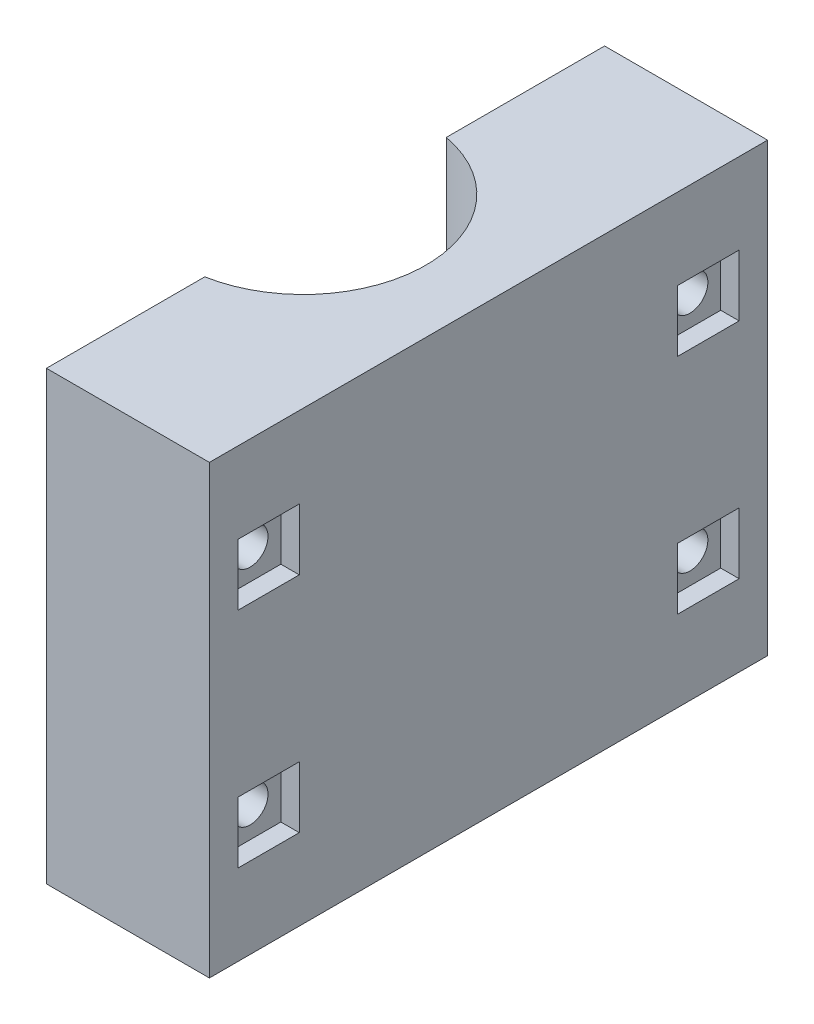
ISO-10303-21;
HEADER;
FILE_DESCRIPTION(('STEP AP214'),'2;1');
FILE_NAME('part.step','',(''),(''),'','','');
FILE_SCHEMA(('AUTOMOTIVE_DESIGN { 1 0 10303 214 1 1 1 1 }'));
ENDSEC;
DATA;
#1=APPLICATION_CONTEXT('core data for automotive mechanical design processes');
#2=APPLICATION_PROTOCOL_DEFINITION('international standard','automotive_design',2000,#1);
#3=PRODUCT_CONTEXT('',#1,'mechanical');
#4=PRODUCT('Part','Part','',(#3));
#5=PRODUCT_RELATED_PRODUCT_CATEGORY('part','',(#4));
#6=PRODUCT_DEFINITION_FORMATION('','',#4);
#7=PRODUCT_DEFINITION_CONTEXT('part definition',#1,'design');
#8=PRODUCT_DEFINITION('design','',#6,#7);
#9=PRODUCT_DEFINITION_SHAPE('','',#8);
#10=(LENGTH_UNIT() NAMED_UNIT(*) SI_UNIT(.MILLI.,.METRE.));
#11=(NAMED_UNIT(*) PLANE_ANGLE_UNIT() SI_UNIT($,.RADIAN.));
#12=(NAMED_UNIT(*) SI_UNIT($,.STERADIAN.) SOLID_ANGLE_UNIT());
#13=UNCERTAINTY_MEASURE_WITH_UNIT(LENGTH_MEASURE(1.E-05),#10,'distance_accuracy_value','');
#14=(GEOMETRIC_REPRESENTATION_CONTEXT(3) GLOBAL_UNCERTAINTY_ASSIGNED_CONTEXT((#13)) GLOBAL_UNIT_ASSIGNED_CONTEXT((#10,
#11,#12)) REPRESENTATION_CONTEXT('',''));
#15=CARTESIAN_POINT('',(0.,0.,0.));
#16=DIRECTION('',(0.,0.,1.));
#17=DIRECTION('',(1.,0.,0.));
#18=AXIS2_PLACEMENT_3D('',#15,#16,#17);
#19=CARTESIAN_POINT('',(-5.74736391748427,38.1,-6.731));
#20=DIRECTION('',(1.,0.,0.));
#21=DIRECTION('',(0.,0.,-1.));
#22=AXIS2_PLACEMENT_3D('',#19,#20,#21);
#23=CYLINDRICAL_SURFACE('',#22,2.032);
#24=CARTESIAN_POINT('',(0.,38.1,-6.731));
#25=DIRECTION('',(1.,0.,0.));
#26=DIRECTION('',(0.,0.,-1.));
#27=AXIS2_PLACEMENT_3D('',#24,#25,#26);
#28=CIRCLE('',#27,2.032);
#29=CARTESIAN_POINT('',(0.,38.1,-8.763));
#30=VERTEX_POINT('',#29);
#31=EDGE_CURVE('E359',#30,#30,#28,.F.);
#32=ORIENTED_EDGE('',*,*,#31,.T.);
#33=EDGE_LOOP('',(#32));
#34=FACE_BOUND('',#33,.T.);
#35=CARTESIAN_POINT('',(16.4465,38.1,-6.731));
#36=DIRECTION('',(1.,0.,0.));
#37=DIRECTION('',(0.,0.,-1.));
#38=AXIS2_PLACEMENT_3D('',#35,#36,#37);
#39=CIRCLE('',#38,2.032);
#40=CARTESIAN_POINT('',(16.4465,38.1,-8.763));
#41=VERTEX_POINT('',#40);
#42=EDGE_CURVE('E43',#41,#41,#39,.F.);
#43=ORIENTED_EDGE('',*,*,#42,.F.);
#44=EDGE_LOOP('',(#43));
#45=FACE_BOUND('',#44,.T.);
#46=ADVANCED_FACE('F39',(#34,#45),#23,.F.);
#47=CARTESIAN_POINT('',(-5.74736391748429,38.1,-56.769));
#48=DIRECTION('',(1.,0.,0.));
#49=DIRECTION('',(0.,0.,-1.));
#50=AXIS2_PLACEMENT_3D('',#47,#48,#49);
#51=CYLINDRICAL_SURFACE('',#50,2.032);
#52=CARTESIAN_POINT('',(0.,38.1,-56.769));
#53=DIRECTION('',(1.,0.,0.));
#54=DIRECTION('',(0.,0.,-1.));
#55=AXIS2_PLACEMENT_3D('',#52,#53,#54);
#56=CIRCLE('',#55,2.032);
#57=CARTESIAN_POINT('',(0.,38.1,-58.801));
#58=VERTEX_POINT('',#57);
#59=EDGE_CURVE('E355',#58,#58,#56,.F.);
#60=ORIENTED_EDGE('',*,*,#59,.T.);
#61=EDGE_LOOP('',(#60));
#62=FACE_BOUND('',#61,.T.);
#63=CARTESIAN_POINT('',(16.4465,38.1,-56.769));
#64=DIRECTION('',(1.,0.,0.));
#65=DIRECTION('',(0.,0.,-1.));
#66=AXIS2_PLACEMENT_3D('',#63,#64,#65);
#67=CIRCLE('',#66,2.032);
#68=CARTESIAN_POINT('',(16.4465,38.1,-58.801));
#69=VERTEX_POINT('',#68);
#70=EDGE_CURVE('E435',#69,#69,#67,.F.);
#71=ORIENTED_EDGE('',*,*,#70,.F.);
#72=EDGE_LOOP('',(#71));
#73=FACE_BOUND('',#72,.T.);
#74=ADVANCED_FACE('F447',(#62,#73),#51,.F.);
#75=CARTESIAN_POINT('',(-5.74736391748429,12.7,-56.769));
#76=DIRECTION('',(1.,0.,0.));
#77=DIRECTION('',(0.,0.,-1.));
#78=AXIS2_PLACEMENT_3D('',#75,#76,#77);
#79=CYLINDRICAL_SURFACE('',#78,2.03200000000001);
#80=CARTESIAN_POINT('',(0.,12.7,-56.769));
#81=DIRECTION('',(1.,0.,0.));
#82=DIRECTION('',(0.,0.,-1.));
#83=AXIS2_PLACEMENT_3D('',#80,#81,#82);
#84=CIRCLE('',#83,2.03200000000001);
#85=CARTESIAN_POINT('',(0.,12.7,-58.801));
#86=VERTEX_POINT('',#85);
#87=EDGE_CURVE('E360',#86,#86,#84,.F.);
#88=ORIENTED_EDGE('',*,*,#87,.T.);
#89=EDGE_LOOP('',(#88));
#90=FACE_BOUND('',#89,.T.);
#91=CARTESIAN_POINT('',(16.4465,12.7,-56.769));
#92=DIRECTION('',(1.,0.,0.));
#93=DIRECTION('',(0.,0.,-1.));
#94=AXIS2_PLACEMENT_3D('',#91,#92,#93);
#95=CIRCLE('',#94,2.03200000000001);
#96=CARTESIAN_POINT('',(16.4465,12.7,-58.801));
#97=VERTEX_POINT('',#96);
#98=EDGE_CURVE('E432',#97,#97,#95,.F.);
#99=ORIENTED_EDGE('',*,*,#98,.F.);
#100=EDGE_LOOP('',(#99));
#101=FACE_BOUND('',#100,.T.);
#102=ADVANCED_FACE('F453',(#90,#101),#79,.F.);
#103=CARTESIAN_POINT('',(-5.74736391748427,12.7,-6.73099999999998));
#104=DIRECTION('',(1.,0.,0.));
#105=DIRECTION('',(0.,0.,-1.));
#106=AXIS2_PLACEMENT_3D('',#103,#104,#105);
#107=CYLINDRICAL_SURFACE('',#106,2.03200000000001);
#108=CARTESIAN_POINT('',(0.,12.7,-6.73099999999999));
#109=DIRECTION('',(1.,0.,0.));
#110=DIRECTION('',(0.,0.,-1.));
#111=AXIS2_PLACEMENT_3D('',#108,#109,#110);
#112=CIRCLE('',#111,2.03200000000001);
#113=CARTESIAN_POINT('',(0.,12.7,-8.76299999999999));
#114=VERTEX_POINT('',#113);
#115=EDGE_CURVE('E364',#114,#114,#112,.F.);
#116=ORIENTED_EDGE('',*,*,#115,.T.);
#117=EDGE_LOOP('',(#116));
#118=FACE_BOUND('',#117,.T.);
#119=CARTESIAN_POINT('',(16.4465,12.7,-6.73099999999999));
#120=DIRECTION('',(1.,0.,0.));
#121=DIRECTION('',(0.,0.,-1.));
#122=AXIS2_PLACEMENT_3D('',#119,#120,#121);
#123=CIRCLE('',#122,2.03200000000001);
#124=CARTESIAN_POINT('',(16.4465,12.7,-8.76299999999999));
#125=VERTEX_POINT('',#124);
#126=EDGE_CURVE('E354',#125,#125,#123,.F.);
#127=ORIENTED_EDGE('',*,*,#126,.F.);
#128=EDGE_LOOP('',(#127));
#129=FACE_BOUND('',#128,.T.);
#130=ADVANCED_FACE('F458',(#118,#129),#107,.F.);
#131=CARTESIAN_POINT('',(0.,116.951763120872,0.));
#132=DIRECTION('',(1.,0.,0.));
#133=DIRECTION('',(0.,0.,-1.));
#134=AXIS2_PLACEMENT_3D('',#131,#132,#133);
#135=PLANE('',#134);
#136=ORIENTED_EDGE('',*,*,#87,.F.);
#137=EDGE_LOOP('',(#136));
#138=FACE_BOUND('',#137,.T.);
#139=ORIENTED_EDGE('',*,*,#59,.F.);
#140=EDGE_LOOP('',(#139));
#141=FACE_BOUND('',#140,.T.);
#142=DIRECTION('',(0.,0.,1.));
#143=VECTOR('',#142,1.);
#144=CARTESIAN_POINT('',(0.,0.,0.));
#145=LINE('',#144,#143);
#146=CARTESIAN_POINT('',(0.,0.,-63.5));
#147=VERTEX_POINT('',#146);
#148=CARTESIAN_POINT('',(0.,0.,-45.4871503595178));
#149=VERTEX_POINT('',#148);
#150=EDGE_CURVE('E400',#147,#149,#145,.T.);
#151=ORIENTED_EDGE('',*,*,#150,.T.);
#152=DIRECTION('',(0.,1.,0.));
#153=VECTOR('',#152,1.);
#154=CARTESIAN_POINT('',(0.,-31.2378696456721,-45.4871503595178));
#155=LINE('',#154,#153);
#156=CARTESIAN_POINT('',(0.,50.8,-45.4871503595178));
#157=VERTEX_POINT('',#156);
#158=EDGE_CURVE('E379',#149,#157,#155,.T.);
#159=ORIENTED_EDGE('',*,*,#158,.T.);
#160=DIRECTION('',(0.,0.,1.));
#161=VECTOR('',#160,1.);
#162=CARTESIAN_POINT('',(0.,50.8,0.));
#163=LINE('',#162,#161);
#164=CARTESIAN_POINT('',(0.,50.8,-63.5));
#165=VERTEX_POINT('',#164);
#166=EDGE_CURVE('E412',#165,#157,#163,.T.);
#167=ORIENTED_EDGE('',*,*,#166,.F.);
#168=DIRECTION('',(0.,-1.,0.));
#169=VECTOR('',#168,1.);
#170=CARTESIAN_POINT('',(0.,116.951763120872,-63.5));
#171=LINE('',#170,#169);
#172=EDGE_CURVE('E383',#165,#147,#171,.T.);
#173=ORIENTED_EDGE('',*,*,#172,.T.);
#174=EDGE_LOOP('',(#151,#159,#167,#173));
#175=FACE_BOUND('',#174,.T.);
#176=ADVANCED_FACE('F481',(#138,#141,#175),#135,.F.);
#177=ORIENTED_EDGE('',*,*,#115,.F.);
#178=EDGE_LOOP('',(#177));
#179=FACE_BOUND('',#178,.T.);
#180=ORIENTED_EDGE('',*,*,#31,.F.);
#181=EDGE_LOOP('',(#180));
#182=FACE_BOUND('',#181,.T.);
#183=CARTESIAN_POINT('',(0.,50.8,-18.0128496404822));
#184=VERTEX_POINT('',#183);
#185=CARTESIAN_POINT('',(0.,50.8,0.));
#186=VERTEX_POINT('',#185);
#187=EDGE_CURVE('E416',#184,#186,#163,.T.);
#188=ORIENTED_EDGE('',*,*,#187,.F.);
#189=DIRECTION('',(0.,1.,0.));
#190=VECTOR('',#189,1.);
#191=CARTESIAN_POINT('',(0.,-31.2378696456721,-18.0128496404822));
#192=LINE('',#191,#190);
#193=CARTESIAN_POINT('',(0.,0.,-18.0128496404822));
#194=VERTEX_POINT('',#193);
#195=EDGE_CURVE('E375',#184,#194,#192,.F.);
#196=ORIENTED_EDGE('',*,*,#195,.T.);
#197=CARTESIAN_POINT('',(0.,0.,0.));
#198=VERTEX_POINT('',#197);
#199=EDGE_CURVE('E404',#194,#198,#145,.T.);
#200=ORIENTED_EDGE('',*,*,#199,.T.);
#201=DIRECTION('',(0.,-1.,0.));
#202=VECTOR('',#201,1.);
#203=CARTESIAN_POINT('',(0.,116.951763120872,0.));
#204=LINE('',#203,#202);
#205=EDGE_CURVE('E399',#186,#198,#204,.T.);
#206=ORIENTED_EDGE('',*,*,#205,.F.);
#207=EDGE_LOOP('',(#188,#196,#200,#206));
#208=FACE_BOUND('',#207,.T.);
#209=ADVANCED_FACE('F478',(#179,#182,#208),#135,.F.);
#210=CARTESIAN_POINT('',(0.,116.951763120872,0.));
#211=DIRECTION('',(0.,0.,-1.));
#212=DIRECTION('',(-1.,0.,0.));
#213=AXIS2_PLACEMENT_3D('',#210,#211,#212);
#214=PLANE('',#213);
#215=DIRECTION('',(1.,0.,0.));
#216=VECTOR('',#215,1.);
#217=CARTESIAN_POINT('',(0.,50.8,0.));
#218=LINE('',#217,#216);
#219=CARTESIAN_POINT('',(18.542,50.8,0.));
#220=VERTEX_POINT('',#219);
#221=EDGE_CURVE('E408',#186,#220,#218,.T.);
#222=ORIENTED_EDGE('',*,*,#221,.F.);
#223=ORIENTED_EDGE('',*,*,#205,.T.);
#224=DIRECTION('',(1.,0.,0.));
#225=VECTOR('',#224,1.);
#226=CARTESIAN_POINT('',(0.,0.,0.));
#227=LINE('',#226,#225);
#228=CARTESIAN_POINT('',(18.542,0.,0.));
#229=VERTEX_POINT('',#228);
#230=EDGE_CURVE('E395',#198,#229,#227,.T.);
#231=ORIENTED_EDGE('',*,*,#230,.T.);
#232=DIRECTION('',(0.,-1.,0.));
#233=VECTOR('',#232,1.);
#234=CARTESIAN_POINT('',(18.542,116.951763120872,0.));
#235=LINE('',#234,#233);
#236=EDGE_CURVE('E394',#220,#229,#235,.T.);
#237=ORIENTED_EDGE('',*,*,#236,.F.);
#238=EDGE_LOOP('',(#222,#223,#231,#237));
#239=FACE_BOUND('',#238,.T.);
#240=ADVANCED_FACE('F475',(#239),#214,.F.);
#241=CARTESIAN_POINT('',(18.542,116.951763120872,0.));
#242=DIRECTION('',(-1.,0.,0.));
#243=DIRECTION('',(0.,0.,1.));
#244=AXIS2_PLACEMENT_3D('',#241,#242,#243);
#245=PLANE('',#244);
#246=DIRECTION('',(0.,0.,1.));
#247=VECTOR('',#246,1.);
#248=CARTESIAN_POINT('',(18.542,16.1925,-60.2615));
#249=LINE('',#248,#247);
#250=CARTESIAN_POINT('',(18.542,16.1925,-60.2615));
#251=VERTEX_POINT('',#250);
#252=CARTESIAN_POINT('',(18.542,16.1925,-53.2765));
#253=VERTEX_POINT('',#252);
#254=EDGE_CURVE('E251',#251,#253,#249,.T.);
#255=ORIENTED_EDGE('',*,*,#254,.F.);
#256=DIRECTION('',(0.,1.,0.));
#257=VECTOR('',#256,1.);
#258=CARTESIAN_POINT('',(18.542,16.1925,-60.2615));
#259=LINE('',#258,#257);
#260=CARTESIAN_POINT('',(18.542,9.20749999999999,-60.2615));
#261=VERTEX_POINT('',#260);
#262=EDGE_CURVE('E57',#261,#251,#259,.T.);
#263=ORIENTED_EDGE('',*,*,#262,.F.);
#264=DIRECTION('',(0.,0.,-1.));
#265=VECTOR('',#264,1.);
#266=CARTESIAN_POINT('',(18.542,9.20749999999999,-60.2615));
#267=LINE('',#266,#265);
#268=CARTESIAN_POINT('',(18.542,9.20749999999999,-53.2765));
#269=VERTEX_POINT('',#268);
#270=EDGE_CURVE('E260',#269,#261,#267,.T.);
#271=ORIENTED_EDGE('',*,*,#270,.F.);
#272=DIRECTION('',(0.,-1.,0.));
#273=VECTOR('',#272,1.);
#274=CARTESIAN_POINT('',(18.542,16.1925,-53.2765));
#275=LINE('',#274,#273);
#276=EDGE_CURVE('E256',#253,#269,#275,.T.);
#277=ORIENTED_EDGE('',*,*,#276,.F.);
#278=EDGE_LOOP('',(#255,#263,#271,#277));
#279=FACE_BOUND('',#278,.T.);
#280=DIRECTION('',(0.,0.,-1.));
#281=VECTOR('',#280,1.);
#282=CARTESIAN_POINT('',(18.542,34.6075,-3.23850000000001));
#283=LINE('',#282,#281);
#284=CARTESIAN_POINT('',(18.542,34.6075,-3.23850000000001));
#285=VERTEX_POINT('',#284);
#286=CARTESIAN_POINT('',(18.542,34.6075,-10.2235));
#287=VERTEX_POINT('',#286);
#288=EDGE_CURVE('E290',#285,#287,#283,.T.);
#289=ORIENTED_EDGE('',*,*,#288,.F.);
#290=DIRECTION('',(0.,-1.,0.));
#291=VECTOR('',#290,1.);
#292=CARTESIAN_POINT('',(18.542,34.6075,-3.23850000000001));
#293=LINE('',#292,#291);
#294=CARTESIAN_POINT('',(18.542,41.5925,-3.23850000000001));
#295=VERTEX_POINT('',#294);
#296=EDGE_CURVE('E65',#295,#285,#293,.T.);
#297=ORIENTED_EDGE('',*,*,#296,.F.);
#298=DIRECTION('',(0.,0.,1.));
#299=VECTOR('',#298,1.);
#300=CARTESIAN_POINT('',(18.542,41.5925,-3.23850000000001));
#301=LINE('',#300,#299);
#302=CARTESIAN_POINT('',(18.542,41.5925,-10.2235));
#303=VERTEX_POINT('',#302);
#304=EDGE_CURVE('E298',#303,#295,#301,.T.);
#305=ORIENTED_EDGE('',*,*,#304,.F.);
#306=DIRECTION('',(0.,1.,0.));
#307=VECTOR('',#306,1.);
#308=CARTESIAN_POINT('',(18.542,34.6075,-10.2235));
#309=LINE('',#308,#307);
#310=EDGE_CURVE('E294',#287,#303,#309,.T.);
#311=ORIENTED_EDGE('',*,*,#310,.F.);
#312=EDGE_LOOP('',(#289,#297,#305,#311));
#313=FACE_BOUND('',#312,.T.);
#314=DIRECTION('',(0.,-1.,0.));
#315=VECTOR('',#314,1.);
#316=CARTESIAN_POINT('',(18.542,16.1925,-3.23850000000001));
#317=LINE('',#316,#315);
#318=CARTESIAN_POINT('',(18.542,16.1925,-3.23850000000001));
#319=VERTEX_POINT('',#318);
#320=CARTESIAN_POINT('',(18.542,9.20749999999999,-3.23850000000001));
#321=VERTEX_POINT('',#320);
#322=EDGE_CURVE('E209',#319,#321,#317,.T.);
#323=ORIENTED_EDGE('',*,*,#322,.F.);
#324=DIRECTION('',(0.,0.,1.));
#325=VECTOR('',#324,1.);
#326=CARTESIAN_POINT('',(18.542,16.1925,-3.23850000000001));
#327=LINE('',#326,#325);
#328=CARTESIAN_POINT('',(18.542,16.1925,-10.2235));
#329=VERTEX_POINT('',#328);
#330=EDGE_CURVE('E215',#329,#319,#327,.T.);
#331=ORIENTED_EDGE('',*,*,#330,.F.);
#332=DIRECTION('',(0.,1.,0.));
#333=VECTOR('',#332,1.);
#334=CARTESIAN_POINT('',(18.542,16.1925,-10.2235));
#335=LINE('',#334,#333);
#336=CARTESIAN_POINT('',(18.542,9.20749999999999,-10.2235));
#337=VERTEX_POINT('',#336);
#338=EDGE_CURVE('E220',#337,#329,#335,.T.);
#339=ORIENTED_EDGE('',*,*,#338,.F.);
#340=DIRECTION('',(0.,0.,-1.));
#341=VECTOR('',#340,1.);
#342=CARTESIAN_POINT('',(18.542,9.20749999999999,-3.23850000000001));
#343=LINE('',#342,#341);
#344=EDGE_CURVE('E197',#321,#337,#343,.T.);
#345=ORIENTED_EDGE('',*,*,#344,.F.);
#346=EDGE_LOOP('',(#323,#331,#339,#345));
#347=FACE_BOUND('',#346,.T.);
#348=DIRECTION('',(0.,0.,-1.));
#349=VECTOR('',#348,1.);
#350=CARTESIAN_POINT('',(18.542,34.6075,-60.2615));
#351=LINE('',#350,#349);
#352=CARTESIAN_POINT('',(18.542,34.6075,-53.2765));
#353=VERTEX_POINT('',#352);
#354=CARTESIAN_POINT('',(18.542,34.6075,-60.2615));
#355=VERTEX_POINT('',#354);
#356=EDGE_CURVE('E328',#353,#355,#351,.T.);
#357=ORIENTED_EDGE('',*,*,#356,.F.);
#358=DIRECTION('',(0.,-1.,0.));
#359=VECTOR('',#358,1.);
#360=CARTESIAN_POINT('',(18.542,34.6075,-53.2765));
#361=LINE('',#360,#359);
#362=CARTESIAN_POINT('',(18.542,41.5925,-53.2765));
#363=VERTEX_POINT('',#362);
#364=EDGE_CURVE('E277',#363,#353,#361,.T.);
#365=ORIENTED_EDGE('',*,*,#364,.F.);
#366=DIRECTION('',(0.,0.,1.));
#367=VECTOR('',#366,1.);
#368=CARTESIAN_POINT('',(18.542,41.5925,-60.2615));
#369=LINE('',#368,#367);
#370=CARTESIAN_POINT('',(18.542,41.5925,-60.2615));
#371=VERTEX_POINT('',#370);
#372=EDGE_CURVE('E336',#371,#363,#369,.T.);
#373=ORIENTED_EDGE('',*,*,#372,.F.);
#374=DIRECTION('',(0.,1.,0.));
#375=VECTOR('',#374,1.);
#376=CARTESIAN_POINT('',(18.542,34.6075,-60.2615));
#377=LINE('',#376,#375);
#378=EDGE_CURVE('E332',#355,#371,#377,.T.);
#379=ORIENTED_EDGE('',*,*,#378,.F.);
#380=EDGE_LOOP('',(#357,#365,#373,#379));
#381=FACE_BOUND('',#380,.T.);
#382=DIRECTION('',(0.,0.,-1.));
#383=VECTOR('',#382,1.);
#384=CARTESIAN_POINT('',(18.542,50.8,0.));
#385=LINE('',#384,#383);
#386=CARTESIAN_POINT('',(18.542,50.8,-63.5));
#387=VERTEX_POINT('',#386);
#388=EDGE_CURVE('E49',#220,#387,#385,.T.);
#389=ORIENTED_EDGE('',*,*,#388,.F.);
#390=ORIENTED_EDGE('',*,*,#236,.T.);
#391=DIRECTION('',(0.,0.,-1.));
#392=VECTOR('',#391,1.);
#393=CARTESIAN_POINT('',(18.542,0.,0.));
#394=LINE('',#393,#392);
#395=CARTESIAN_POINT('',(18.542,0.,-63.5));
#396=VERTEX_POINT('',#395);
#397=EDGE_CURVE('E390',#229,#396,#394,.T.);
#398=ORIENTED_EDGE('',*,*,#397,.T.);
#399=DIRECTION('',(0.,-1.,0.));
#400=VECTOR('',#399,1.);
#401=CARTESIAN_POINT('',(18.542,116.951763120872,-63.5));
#402=LINE('',#401,#400);
#403=EDGE_CURVE('E389',#387,#396,#402,.T.);
#404=ORIENTED_EDGE('',*,*,#403,.F.);
#405=EDGE_LOOP('',(#389,#390,#398,#404));
#406=FACE_BOUND('',#405,.T.);
#407=ADVANCED_FACE('F217',(#279,#313,#347,#381,#406),#245,.F.);
#408=CARTESIAN_POINT('',(0.,116.951763120872,-63.5));
#409=DIRECTION('',(0.,0.,1.));
#410=DIRECTION('',(1.,0.,0.));
#411=AXIS2_PLACEMENT_3D('',#408,#409,#410);
#412=PLANE('',#411);
#413=DIRECTION('',(-1.,0.,0.));
#414=VECTOR('',#413,1.);
#415=CARTESIAN_POINT('',(0.,50.8,-63.5));
#416=LINE('',#415,#414);
#417=EDGE_CURVE('E388',#387,#165,#416,.T.);
#418=ORIENTED_EDGE('',*,*,#417,.F.);
#419=ORIENTED_EDGE('',*,*,#403,.T.);
#420=DIRECTION('',(-1.,0.,0.));
#421=VECTOR('',#420,1.);
#422=CARTESIAN_POINT('',(0.,0.,-63.5));
#423=LINE('',#422,#421);
#424=EDGE_CURVE('E384',#396,#147,#423,.T.);
#425=ORIENTED_EDGE('',*,*,#424,.T.);
#426=ORIENTED_EDGE('',*,*,#172,.F.);
#427=EDGE_LOOP('',(#418,#419,#425,#426));
#428=FACE_BOUND('',#427,.T.);
#429=ADVANCED_FACE('F468',(#428),#412,.F.);
#430=CARTESIAN_POINT('',(0.,0.,0.));
#431=DIRECTION('',(0.,-1.,0.));
#432=DIRECTION('',(0.,0.,-1.));
#433=AXIS2_PLACEMENT_3D('',#430,#431,#432);
#434=PLANE('',#433);
#435=CARTESIAN_POINT('',(-2.54,0.,-31.75));
#436=DIRECTION('',(0.,-1.,0.));
#437=DIRECTION('',(0.,0.,-1.));
#438=AXIS2_PLACEMENT_3D('',#435,#436,#437);
#439=CIRCLE('',#438,13.97);
#440=EDGE_CURVE('E371',#194,#149,#439,.F.);
#441=ORIENTED_EDGE('',*,*,#440,.T.);
#442=ORIENTED_EDGE('',*,*,#150,.F.);
#443=ORIENTED_EDGE('',*,*,#424,.F.);
#444=ORIENTED_EDGE('',*,*,#397,.F.);
#445=ORIENTED_EDGE('',*,*,#230,.F.);
#446=ORIENTED_EDGE('',*,*,#199,.F.);
#447=EDGE_LOOP('',(#441,#442,#443,#444,#445,#446));
#448=FACE_BOUND('',#447,.T.);
#449=ADVANCED_FACE('F465',(#448),#434,.T.);
#450=CARTESIAN_POINT('',(0.,50.8,0.));
#451=DIRECTION('',(0.,1.,0.));
#452=DIRECTION('',(0.,0.,1.));
#453=AXIS2_PLACEMENT_3D('',#450,#451,#452);
#454=PLANE('',#453);
#455=CARTESIAN_POINT('',(-2.54,50.8,-31.75));
#456=DIRECTION('',(0.,1.,0.));
#457=DIRECTION('',(0.,0.,1.));
#458=AXIS2_PLACEMENT_3D('',#455,#456,#457);
#459=CIRCLE('',#458,13.97);
#460=EDGE_CURVE('E11',#184,#157,#459,.T.);
#461=ORIENTED_EDGE('',*,*,#460,.F.);
#462=ORIENTED_EDGE('',*,*,#187,.T.);
#463=ORIENTED_EDGE('',*,*,#221,.T.);
#464=ORIENTED_EDGE('',*,*,#388,.T.);
#465=ORIENTED_EDGE('',*,*,#417,.T.);
#466=ORIENTED_EDGE('',*,*,#166,.T.);
#467=EDGE_LOOP('',(#461,#462,#463,#464,#465,#466));
#468=FACE_BOUND('',#467,.T.);
#469=ADVANCED_FACE('F41',(#468),#454,.T.);
#470=CARTESIAN_POINT('',(-2.54,-31.2378696456721,-31.75));
#471=DIRECTION('',(0.,1.,0.));
#472=DIRECTION('',(0.,0.,1.));
#473=AXIS2_PLACEMENT_3D('',#470,#471,#472);
#474=CYLINDRICAL_SURFACE('',#473,13.97);
#475=ORIENTED_EDGE('',*,*,#440,.F.);
#476=ORIENTED_EDGE('',*,*,#195,.F.);
#477=ORIENTED_EDGE('',*,*,#460,.T.);
#478=ORIENTED_EDGE('',*,*,#158,.F.);
#479=EDGE_LOOP('',(#475,#476,#477,#478));
#480=FACE_BOUND('',#479,.T.);
#481=ADVANCED_FACE('F460',(#480),#474,.F.);
#482=CARTESIAN_POINT('',(16.4465,0.,0.));
#483=DIRECTION('',(1.,0.,0.));
#484=DIRECTION('',(0.,0.,-1.));
#485=AXIS2_PLACEMENT_3D('',#482,#483,#484);
#486=PLANE('',#485);
#487=DIRECTION('',(0.,0.,-1.));
#488=VECTOR('',#487,1.);
#489=CARTESIAN_POINT('',(16.4465,16.1925,-3.23850000000001));
#490=LINE('',#489,#488);
#491=CARTESIAN_POINT('',(16.4465,16.1925,-3.23850000000001));
#492=VERTEX_POINT('',#491);
#493=CARTESIAN_POINT('',(16.4465,16.1925,-10.2235));
#494=VERTEX_POINT('',#493);
#495=EDGE_CURVE('E237',#492,#494,#490,.T.);
#496=ORIENTED_EDGE('',*,*,#495,.F.);
#497=DIRECTION('',(0.,1.,0.));
#498=VECTOR('',#497,1.);
#499=CARTESIAN_POINT('',(16.4465,16.1925,-3.23850000000001));
#500=LINE('',#499,#498);
#501=CARTESIAN_POINT('',(16.4465,9.20749999999999,-3.23850000000001));
#502=VERTEX_POINT('',#501);
#503=EDGE_CURVE('E234',#502,#492,#500,.T.);
#504=ORIENTED_EDGE('',*,*,#503,.F.);
#505=DIRECTION('',(0.,0.,1.));
#506=VECTOR('',#505,1.);
#507=CARTESIAN_POINT('',(16.4465,9.20749999999999,-3.23850000000001));
#508=LINE('',#507,#506);
#509=CARTESIAN_POINT('',(16.4465,9.20749999999999,-10.2235));
#510=VERTEX_POINT('',#509);
#511=EDGE_CURVE('E200',#510,#502,#508,.T.);
#512=ORIENTED_EDGE('',*,*,#511,.F.);
#513=DIRECTION('',(0.,-1.,0.));
#514=VECTOR('',#513,1.);
#515=CARTESIAN_POINT('',(16.4465,16.1925,-10.2235));
#516=LINE('',#515,#514);
#517=EDGE_CURVE('E818',#494,#510,#516,.T.);
#518=ORIENTED_EDGE('',*,*,#517,.F.);
#519=EDGE_LOOP('',(#496,#504,#512,#518));
#520=FACE_BOUND('',#519,.T.);
#521=ORIENTED_EDGE('',*,*,#126,.T.);
#522=EDGE_LOOP('',(#521));
#523=FACE_BOUND('',#522,.T.);
#524=ADVANCED_FACE('F463',(#520,#523),#486,.T.);
#525=CARTESIAN_POINT('',(6.56821826682394,16.1925,-3.23850000000001));
#526=DIRECTION('',(0.,1.,0.));
#527=DIRECTION('',(0.,0.,1.));
#528=AXIS2_PLACEMENT_3D('',#525,#526,#527);
#529=PLANE('',#528);
#530=ORIENTED_EDGE('',*,*,#495,.T.);
#531=DIRECTION('',(1.,0.,0.));
#532=VECTOR('',#531,1.);
#533=CARTESIAN_POINT('',(6.56821826682393,16.1925,-10.2235));
#534=LINE('',#533,#532);
#535=EDGE_CURVE('E227',#494,#329,#534,.T.);
#536=ORIENTED_EDGE('',*,*,#535,.T.);
#537=ORIENTED_EDGE('',*,*,#330,.T.);
#538=DIRECTION('',(1.,0.,0.));
#539=VECTOR('',#538,1.);
#540=CARTESIAN_POINT('',(6.56821826682394,16.1925,-3.23850000000001));
#541=LINE('',#540,#539);
#542=EDGE_CURVE('E205',#492,#319,#541,.T.);
#543=ORIENTED_EDGE('',*,*,#542,.F.);
#544=EDGE_LOOP('',(#530,#536,#537,#543));
#545=FACE_BOUND('',#544,.T.);
#546=ADVANCED_FACE('F524',(#545),#529,.F.);
#547=CARTESIAN_POINT('',(6.56821826682393,16.1925,-10.2235));
#548=DIRECTION('',(0.,0.,-1.));
#549=DIRECTION('',(-1.,0.,0.));
#550=AXIS2_PLACEMENT_3D('',#547,#548,#549);
#551=PLANE('',#550);
#552=ORIENTED_EDGE('',*,*,#517,.T.);
#553=DIRECTION('',(1.,0.,0.));
#554=VECTOR('',#553,1.);
#555=CARTESIAN_POINT('',(6.56821826682393,9.20749999999999,-10.2235));
#556=LINE('',#555,#554);
#557=EDGE_CURVE('E204',#510,#337,#556,.T.);
#558=ORIENTED_EDGE('',*,*,#557,.T.);
#559=ORIENTED_EDGE('',*,*,#338,.T.);
#560=ORIENTED_EDGE('',*,*,#535,.F.);
#561=EDGE_LOOP('',(#552,#558,#559,#560));
#562=FACE_BOUND('',#561,.T.);
#563=ADVANCED_FACE('F533',(#562),#551,.F.);
#564=CARTESIAN_POINT('',(6.56821826682394,9.20749999999999,-3.23850000000001));
#565=DIRECTION('',(0.,-1.,0.));
#566=DIRECTION('',(0.,0.,-1.));
#567=AXIS2_PLACEMENT_3D('',#564,#565,#566);
#568=PLANE('',#567);
#569=ORIENTED_EDGE('',*,*,#511,.T.);
#570=DIRECTION('',(1.,0.,0.));
#571=VECTOR('',#570,1.);
#572=CARTESIAN_POINT('',(6.56821826682394,9.20749999999999,-3.23850000000001));
#573=LINE('',#572,#571);
#574=EDGE_CURVE('E192',#502,#321,#573,.T.);
#575=ORIENTED_EDGE('',*,*,#574,.T.);
#576=ORIENTED_EDGE('',*,*,#344,.T.);
#577=ORIENTED_EDGE('',*,*,#557,.F.);
#578=EDGE_LOOP('',(#569,#575,#576,#577));
#579=FACE_BOUND('',#578,.T.);
#580=ADVANCED_FACE('F194',(#579),#568,.F.);
#581=CARTESIAN_POINT('',(6.56821826682394,16.1925,-3.23850000000001));
#582=DIRECTION('',(0.,0.,1.));
#583=DIRECTION('',(1.,0.,0.));
#584=AXIS2_PLACEMENT_3D('',#581,#582,#583);
#585=PLANE('',#584);
#586=ORIENTED_EDGE('',*,*,#503,.T.);
#587=ORIENTED_EDGE('',*,*,#542,.T.);
#588=ORIENTED_EDGE('',*,*,#322,.T.);
#589=ORIENTED_EDGE('',*,*,#574,.F.);
#590=EDGE_LOOP('',(#586,#587,#588,#589));
#591=FACE_BOUND('',#590,.T.);
#592=ADVANCED_FACE('F210',(#591),#585,.F.);
#593=CARTESIAN_POINT('',(16.4465,0.,0.));
#594=DIRECTION('',(1.,0.,0.));
#595=DIRECTION('',(0.,0.,-1.));
#596=AXIS2_PLACEMENT_3D('',#593,#594,#595);
#597=PLANE('',#596);
#598=DIRECTION('',(0.,-1.,0.));
#599=VECTOR('',#598,1.);
#600=CARTESIAN_POINT('',(16.4465,16.1925,-60.2615));
#601=LINE('',#600,#599);
#602=CARTESIAN_POINT('',(16.4465,16.1925,-60.2615));
#603=VERTEX_POINT('',#602);
#604=CARTESIAN_POINT('',(16.4465,9.20749999999999,-60.2615));
#605=VERTEX_POINT('',#604);
#606=EDGE_CURVE('E245',#603,#605,#601,.T.);
#607=ORIENTED_EDGE('',*,*,#606,.F.);
#608=DIRECTION('',(0.,0.,-1.));
#609=VECTOR('',#608,1.);
#610=CARTESIAN_POINT('',(16.4465,16.1925,-60.2615));
#611=LINE('',#610,#609);
#612=CARTESIAN_POINT('',(16.4465,16.1925,-53.2765));
#613=VERTEX_POINT('',#612);
#614=EDGE_CURVE('E248',#613,#603,#611,.T.);
#615=ORIENTED_EDGE('',*,*,#614,.F.);
#616=DIRECTION('',(0.,1.,0.));
#617=VECTOR('',#616,1.);
#618=CARTESIAN_POINT('',(16.4465,16.1925,-53.2765));
#619=LINE('',#618,#617);
#620=CARTESIAN_POINT('',(16.4465,9.20749999999999,-53.2765));
#621=VERTEX_POINT('',#620);
#622=EDGE_CURVE('E238',#621,#613,#619,.T.);
#623=ORIENTED_EDGE('',*,*,#622,.F.);
#624=DIRECTION('',(0.,0.,1.));
#625=VECTOR('',#624,1.);
#626=CARTESIAN_POINT('',(16.4465,9.20749999999999,-60.2615));
#627=LINE('',#626,#625);
#628=EDGE_CURVE('E241',#605,#621,#627,.T.);
#629=ORIENTED_EDGE('',*,*,#628,.F.);
#630=EDGE_LOOP('',(#607,#615,#623,#629));
#631=FACE_BOUND('',#630,.T.);
#632=ORIENTED_EDGE('',*,*,#98,.T.);
#633=EDGE_LOOP('',(#632));
#634=FACE_BOUND('',#633,.T.);
#635=ADVANCED_FACE('F554',(#631,#634),#597,.T.);
#636=CARTESIAN_POINT('',(6.56821826682392,16.1925,-60.2615));
#637=DIRECTION('',(0.,0.,-1.));
#638=DIRECTION('',(-1.,0.,0.));
#639=AXIS2_PLACEMENT_3D('',#636,#637,#638);
#640=PLANE('',#639);
#641=ORIENTED_EDGE('',*,*,#606,.T.);
#642=DIRECTION('',(1.,0.,0.));
#643=VECTOR('',#642,1.);
#644=CARTESIAN_POINT('',(6.56821826682392,9.20749999999999,-60.2615));
#645=LINE('',#644,#643);
#646=EDGE_CURVE('E242',#605,#261,#645,.T.);
#647=ORIENTED_EDGE('',*,*,#646,.T.);
#648=ORIENTED_EDGE('',*,*,#262,.T.);
#649=DIRECTION('',(1.,0.,0.));
#650=VECTOR('',#649,1.);
#651=CARTESIAN_POINT('',(6.56821826682392,16.1925,-60.2615));
#652=LINE('',#651,#650);
#653=EDGE_CURVE('E264',#603,#251,#652,.T.);
#654=ORIENTED_EDGE('',*,*,#653,.F.);
#655=EDGE_LOOP('',(#641,#647,#648,#654));
#656=FACE_BOUND('',#655,.T.);
#657=ADVANCED_FACE('F561',(#656),#640,.F.);
#658=CARTESIAN_POINT('',(6.56821826682392,9.20749999999999,-60.2615));
#659=DIRECTION('',(0.,-1.,0.));
#660=DIRECTION('',(0.,0.,-1.));
#661=AXIS2_PLACEMENT_3D('',#658,#659,#660);
#662=PLANE('',#661);
#663=ORIENTED_EDGE('',*,*,#628,.T.);
#664=DIRECTION('',(1.,0.,0.));
#665=VECTOR('',#664,1.);
#666=CARTESIAN_POINT('',(6.56821826682392,9.20749999999999,-53.2765));
#667=LINE('',#666,#665);
#668=EDGE_CURVE('E267',#621,#269,#667,.T.);
#669=ORIENTED_EDGE('',*,*,#668,.T.);
#670=ORIENTED_EDGE('',*,*,#270,.T.);
#671=ORIENTED_EDGE('',*,*,#646,.F.);
#672=EDGE_LOOP('',(#663,#669,#670,#671));
#673=FACE_BOUND('',#672,.T.);
#674=ADVANCED_FACE('F569',(#673),#662,.F.);
#675=CARTESIAN_POINT('',(6.56821826682392,16.1925,-53.2765));
#676=DIRECTION('',(0.,0.,1.));
#677=DIRECTION('',(1.,0.,0.));
#678=AXIS2_PLACEMENT_3D('',#675,#676,#677);
#679=PLANE('',#678);
#680=ORIENTED_EDGE('',*,*,#622,.T.);
#681=DIRECTION('',(1.,0.,0.));
#682=VECTOR('',#681,1.);
#683=CARTESIAN_POINT('',(6.56821826682392,16.1925,-53.2765));
#684=LINE('',#683,#682);
#685=EDGE_CURVE('E270',#613,#253,#684,.T.);
#686=ORIENTED_EDGE('',*,*,#685,.T.);
#687=ORIENTED_EDGE('',*,*,#276,.T.);
#688=ORIENTED_EDGE('',*,*,#668,.F.);
#689=EDGE_LOOP('',(#680,#686,#687,#688));
#690=FACE_BOUND('',#689,.T.);
#691=ADVANCED_FACE('F576',(#690),#679,.F.);
#692=CARTESIAN_POINT('',(6.56821826682392,16.1925,-60.2615));
#693=DIRECTION('',(0.,1.,0.));
#694=DIRECTION('',(0.,0.,1.));
#695=AXIS2_PLACEMENT_3D('',#692,#693,#694);
#696=PLANE('',#695);
#697=ORIENTED_EDGE('',*,*,#614,.T.);
#698=ORIENTED_EDGE('',*,*,#653,.T.);
#699=ORIENTED_EDGE('',*,*,#254,.T.);
#700=ORIENTED_EDGE('',*,*,#685,.F.);
#701=EDGE_LOOP('',(#697,#698,#699,#700));
#702=FACE_BOUND('',#701,.T.);
#703=ADVANCED_FACE('F584',(#702),#696,.F.);
#704=CARTESIAN_POINT('',(16.4465,0.,0.));
#705=DIRECTION('',(1.,0.,0.));
#706=DIRECTION('',(0.,0.,-1.));
#707=AXIS2_PLACEMENT_3D('',#704,#705,#706);
#708=PLANE('',#707);
#709=DIRECTION('',(0.,1.,0.));
#710=VECTOR('',#709,1.);
#711=CARTESIAN_POINT('',(16.4465,34.6075,-53.2765));
#712=LINE('',#711,#710);
#713=CARTESIAN_POINT('',(16.4465,34.6075,-53.2765));
#714=VERTEX_POINT('',#713);
#715=CARTESIAN_POINT('',(16.4465,41.5925,-53.2765));
#716=VERTEX_POINT('',#715);
#717=EDGE_CURVE('E322',#714,#716,#712,.T.);
#718=ORIENTED_EDGE('',*,*,#717,.F.);
#719=DIRECTION('',(0.,0.,1.));
#720=VECTOR('',#719,1.);
#721=CARTESIAN_POINT('',(16.4465,34.6075,-60.2615));
#722=LINE('',#721,#720);
#723=CARTESIAN_POINT('',(16.4465,34.6075,-60.2615));
#724=VERTEX_POINT('',#723);
#725=EDGE_CURVE('E325',#724,#714,#722,.T.);
#726=ORIENTED_EDGE('',*,*,#725,.F.);
#727=DIRECTION('',(0.,-1.,0.));
#728=VECTOR('',#727,1.);
#729=CARTESIAN_POINT('',(16.4465,34.6075,-60.2615));
#730=LINE('',#729,#728);
#731=CARTESIAN_POINT('',(16.4465,41.5925,-60.2615));
#732=VERTEX_POINT('',#731);
#733=EDGE_CURVE('E315',#732,#724,#730,.T.);
#734=ORIENTED_EDGE('',*,*,#733,.F.);
#735=DIRECTION('',(0.,0.,-1.));
#736=VECTOR('',#735,1.);
#737=CARTESIAN_POINT('',(16.4465,41.5925,-60.2615));
#738=LINE('',#737,#736);
#739=EDGE_CURVE('E318',#716,#732,#738,.T.);
#740=ORIENTED_EDGE('',*,*,#739,.F.);
#741=EDGE_LOOP('',(#718,#726,#734,#740));
#742=FACE_BOUND('',#741,.T.);
#743=ORIENTED_EDGE('',*,*,#70,.T.);
#744=EDGE_LOOP('',(#743));
#745=FACE_BOUND('',#744,.T.);
#746=ADVANCED_FACE('F592',(#742,#745),#708,.T.);
#747=CARTESIAN_POINT('',(6.56821826682392,34.6075,-53.2765));
#748=DIRECTION('',(0.,0.,1.));
#749=DIRECTION('',(1.,0.,0.));
#750=AXIS2_PLACEMENT_3D('',#747,#748,#749);
#751=PLANE('',#750);
#752=ORIENTED_EDGE('',*,*,#717,.T.);
#753=DIRECTION('',(1.,0.,0.));
#754=VECTOR('',#753,1.);
#755=CARTESIAN_POINT('',(6.56821826682392,41.5925,-53.2765));
#756=LINE('',#755,#754);
#757=EDGE_CURVE('E319',#716,#363,#756,.T.);
#758=ORIENTED_EDGE('',*,*,#757,.T.);
#759=ORIENTED_EDGE('',*,*,#364,.T.);
#760=DIRECTION('',(1.,0.,0.));
#761=VECTOR('',#760,1.);
#762=CARTESIAN_POINT('',(6.56821826682392,34.6075,-53.2765));
#763=LINE('',#762,#761);
#764=EDGE_CURVE('E340',#714,#353,#763,.T.);
#765=ORIENTED_EDGE('',*,*,#764,.F.);
#766=EDGE_LOOP('',(#752,#758,#759,#765));
#767=FACE_BOUND('',#766,.T.);
#768=ADVANCED_FACE('F600',(#767),#751,.F.);
#769=CARTESIAN_POINT('',(6.56821826682392,41.5925,-60.2615));
#770=DIRECTION('',(0.,1.,0.));
#771=DIRECTION('',(0.,0.,1.));
#772=AXIS2_PLACEMENT_3D('',#769,#770,#771);
#773=PLANE('',#772);
#774=ORIENTED_EDGE('',*,*,#739,.T.);
#775=DIRECTION('',(1.,0.,0.));
#776=VECTOR('',#775,1.);
#777=CARTESIAN_POINT('',(6.56821826682392,41.5925,-60.2615));
#778=LINE('',#777,#776);
#779=EDGE_CURVE('E343',#732,#371,#778,.T.);
#780=ORIENTED_EDGE('',*,*,#779,.T.);
#781=ORIENTED_EDGE('',*,*,#372,.T.);
#782=ORIENTED_EDGE('',*,*,#757,.F.);
#783=EDGE_LOOP('',(#774,#780,#781,#782));
#784=FACE_BOUND('',#783,.T.);
#785=ADVANCED_FACE('F608',(#784),#773,.F.);
#786=CARTESIAN_POINT('',(6.56821826682392,34.6075,-60.2615));
#787=DIRECTION('',(0.,0.,-1.));
#788=DIRECTION('',(-1.,0.,0.));
#789=AXIS2_PLACEMENT_3D('',#786,#787,#788);
#790=PLANE('',#789);
#791=ORIENTED_EDGE('',*,*,#733,.T.);
#792=DIRECTION('',(1.,0.,0.));
#793=VECTOR('',#792,1.);
#794=CARTESIAN_POINT('',(6.56821826682392,34.6075,-60.2615));
#795=LINE('',#794,#793);
#796=EDGE_CURVE('E346',#724,#355,#795,.T.);
#797=ORIENTED_EDGE('',*,*,#796,.T.);
#798=ORIENTED_EDGE('',*,*,#378,.T.);
#799=ORIENTED_EDGE('',*,*,#779,.F.);
#800=EDGE_LOOP('',(#791,#797,#798,#799));
#801=FACE_BOUND('',#800,.T.);
#802=ADVANCED_FACE('F616',(#801),#790,.F.);
#803=CARTESIAN_POINT('',(6.56821826682392,34.6075,-60.2615));
#804=DIRECTION('',(0.,-1.,0.));
#805=DIRECTION('',(0.,0.,-1.));
#806=AXIS2_PLACEMENT_3D('',#803,#804,#805);
#807=PLANE('',#806);
#808=ORIENTED_EDGE('',*,*,#725,.T.);
#809=ORIENTED_EDGE('',*,*,#764,.T.);
#810=ORIENTED_EDGE('',*,*,#356,.T.);
#811=ORIENTED_EDGE('',*,*,#796,.F.);
#812=EDGE_LOOP('',(#808,#809,#810,#811));
#813=FACE_BOUND('',#812,.T.);
#814=ADVANCED_FACE('F624',(#813),#807,.F.);
#815=CARTESIAN_POINT('',(16.4465,0.,0.));
#816=DIRECTION('',(1.,0.,0.));
#817=DIRECTION('',(0.,0.,-1.));
#818=AXIS2_PLACEMENT_3D('',#815,#816,#817);
#819=PLANE('',#818);
#820=DIRECTION('',(0.,1.,0.));
#821=VECTOR('',#820,1.);
#822=CARTESIAN_POINT('',(16.4465,34.6075,-3.23850000000001));
#823=LINE('',#822,#821);
#824=CARTESIAN_POINT('',(16.4465,34.6075,-3.23850000000001));
#825=VERTEX_POINT('',#824);
#826=CARTESIAN_POINT('',(16.4465,41.5925,-3.23850000000001));
#827=VERTEX_POINT('',#826);
#828=EDGE_CURVE('E285',#825,#827,#823,.T.);
#829=ORIENTED_EDGE('',*,*,#828,.F.);
#830=DIRECTION('',(0.,0.,1.));
#831=VECTOR('',#830,1.);
#832=CARTESIAN_POINT('',(16.4465,34.6075,-3.23850000000001));
#833=LINE('',#832,#831);
#834=CARTESIAN_POINT('',(16.4465,34.6075,-10.2235));
#835=VERTEX_POINT('',#834);
#836=EDGE_CURVE('E252',#835,#825,#833,.T.);
#837=ORIENTED_EDGE('',*,*,#836,.F.);
#838=DIRECTION('',(0.,-1.,0.));
#839=VECTOR('',#838,1.);
#840=CARTESIAN_POINT('',(16.4465,34.6075,-10.2235));
#841=LINE('',#840,#839);
#842=CARTESIAN_POINT('',(16.4465,41.5925,-10.2235));
#843=VERTEX_POINT('',#842);
#844=EDGE_CURVE('E278',#843,#835,#841,.T.);
#845=ORIENTED_EDGE('',*,*,#844,.F.);
#846=DIRECTION('',(0.,0.,-1.));
#847=VECTOR('',#846,1.);
#848=CARTESIAN_POINT('',(16.4465,41.5925,-3.23850000000001));
#849=LINE('',#848,#847);
#850=EDGE_CURVE('E281',#827,#843,#849,.T.);
#851=ORIENTED_EDGE('',*,*,#850,.F.);
#852=EDGE_LOOP('',(#829,#837,#845,#851));
#853=FACE_BOUND('',#852,.T.);
#854=ORIENTED_EDGE('',*,*,#42,.T.);
#855=EDGE_LOOP('',(#854));
#856=FACE_BOUND('',#855,.T.);
#857=ADVANCED_FACE('F444',(#853,#856),#819,.T.);
#858=CARTESIAN_POINT('',(6.56821826682394,34.6075,-3.23850000000001));
#859=DIRECTION('',(0.,0.,1.));
#860=DIRECTION('',(1.,0.,0.));
#861=AXIS2_PLACEMENT_3D('',#858,#859,#860);
#862=PLANE('',#861);
#863=ORIENTED_EDGE('',*,*,#828,.T.);
#864=DIRECTION('',(1.,0.,0.));
#865=VECTOR('',#864,1.);
#866=CARTESIAN_POINT('',(6.56821826682394,41.5925,-3.23850000000001));
#867=LINE('',#866,#865);
#868=EDGE_CURVE('E282',#827,#295,#867,.T.);
#869=ORIENTED_EDGE('',*,*,#868,.T.);
#870=ORIENTED_EDGE('',*,*,#296,.T.);
#871=DIRECTION('',(1.,0.,0.));
#872=VECTOR('',#871,1.);
#873=CARTESIAN_POINT('',(6.56821826682394,34.6075,-3.23850000000001));
#874=LINE('',#873,#872);
#875=EDGE_CURVE('E302',#825,#285,#874,.T.);
#876=ORIENTED_EDGE('',*,*,#875,.F.);
#877=EDGE_LOOP('',(#863,#869,#870,#876));
#878=FACE_BOUND('',#877,.T.);
#879=ADVANCED_FACE('F639',(#878),#862,.F.);
#880=CARTESIAN_POINT('',(6.56821826682394,41.5925,-3.23850000000001));
#881=DIRECTION('',(0.,1.,0.));
#882=DIRECTION('',(0.,0.,1.));
#883=AXIS2_PLACEMENT_3D('',#880,#881,#882);
#884=PLANE('',#883);
#885=ORIENTED_EDGE('',*,*,#850,.T.);
#886=DIRECTION('',(1.,0.,0.));
#887=VECTOR('',#886,1.);
#888=CARTESIAN_POINT('',(6.56821826682393,41.5925,-10.2235));
#889=LINE('',#888,#887);
#890=EDGE_CURVE('E305',#843,#303,#889,.T.);
#891=ORIENTED_EDGE('',*,*,#890,.T.);
#892=ORIENTED_EDGE('',*,*,#304,.T.);
#893=ORIENTED_EDGE('',*,*,#868,.F.);
#894=EDGE_LOOP('',(#885,#891,#892,#893));
#895=FACE_BOUND('',#894,.T.);
#896=ADVANCED_FACE('F647',(#895),#884,.F.);
#897=CARTESIAN_POINT('',(6.56821826682393,34.6075,-10.2235));
#898=DIRECTION('',(0.,0.,-1.));
#899=DIRECTION('',(-1.,0.,0.));
#900=AXIS2_PLACEMENT_3D('',#897,#898,#899);
#901=PLANE('',#900);
#902=ORIENTED_EDGE('',*,*,#844,.T.);
#903=DIRECTION('',(1.,0.,0.));
#904=VECTOR('',#903,1.);
#905=CARTESIAN_POINT('',(6.56821826682393,34.6075,-10.2235));
#906=LINE('',#905,#904);
#907=EDGE_CURVE('E308',#835,#287,#906,.T.);
#908=ORIENTED_EDGE('',*,*,#907,.T.);
#909=ORIENTED_EDGE('',*,*,#310,.T.);
#910=ORIENTED_EDGE('',*,*,#890,.F.);
#911=EDGE_LOOP('',(#902,#908,#909,#910));
#912=FACE_BOUND('',#911,.T.);
#913=ADVANCED_FACE('F654',(#912),#901,.F.);
#914=CARTESIAN_POINT('',(6.56821826682394,34.6075,-3.23850000000001));
#915=DIRECTION('',(0.,-1.,0.));
#916=DIRECTION('',(0.,0.,-1.));
#917=AXIS2_PLACEMENT_3D('',#914,#915,#916);
#918=PLANE('',#917);
#919=ORIENTED_EDGE('',*,*,#836,.T.);
#920=ORIENTED_EDGE('',*,*,#875,.T.);
#921=ORIENTED_EDGE('',*,*,#288,.T.);
#922=ORIENTED_EDGE('',*,*,#907,.F.);
#923=EDGE_LOOP('',(#919,#920,#921,#922));
#924=FACE_BOUND('',#923,.T.);
#925=ADVANCED_FACE('F662',(#924),#918,.F.);
#926=CLOSED_SHELL('',(#46,#74,#102,#130,#176,#209,#240,#407,#429,#449,#469,#481,#524,#546,#563,
#580,#592,#635,#657,#674,#691,#703,#746,#768,#785,#802,#814,#857,#879,#896,#913,#925));
#927=MANIFOLD_SOLID_BREP('B2',#926);
#928=ADVANCED_BREP_SHAPE_REPRESENTATION('',(#18,#927),#14);
#929=SHAPE_DEFINITION_REPRESENTATION(#9,#928);
ENDSEC;
END-ISO-10303-21;
